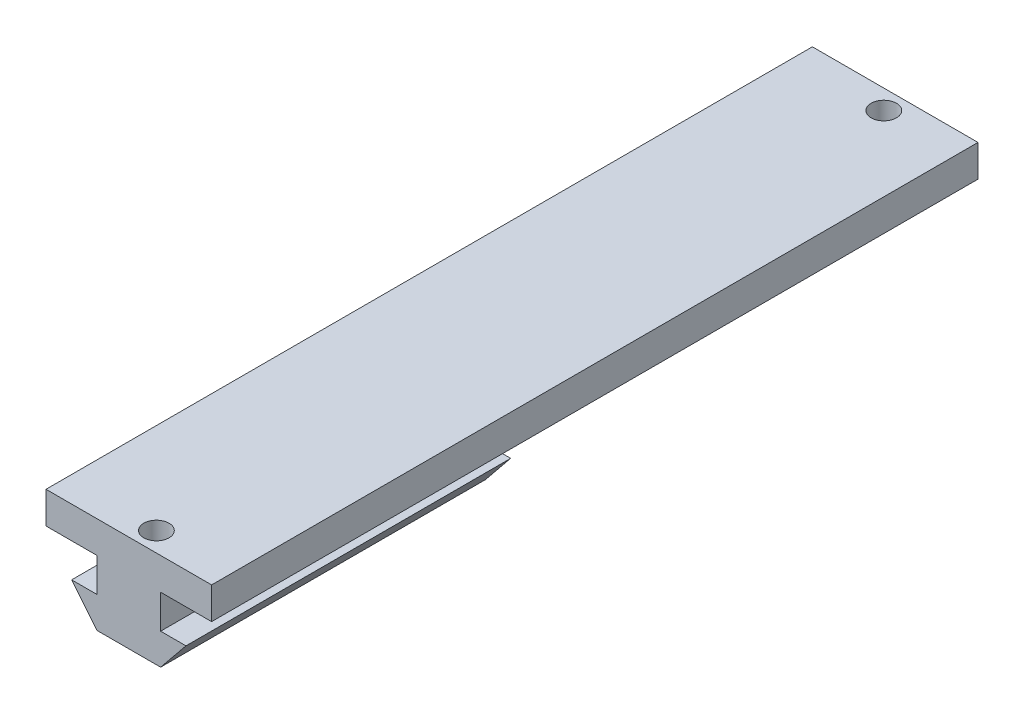
ISO-10303-21;
HEADER;
FILE_DESCRIPTION(('STEP AP214'),'2;1');
FILE_NAME('part.step','',(''),(''),'','','');
FILE_SCHEMA(('AUTOMOTIVE_DESIGN { 1 0 10303 214 1 1 1 1 }'));
ENDSEC;
DATA;
#1=APPLICATION_CONTEXT('core data for automotive mechanical design processes');
#2=APPLICATION_PROTOCOL_DEFINITION('international standard','automotive_design',2000,#1);
#3=PRODUCT_CONTEXT('',#1,'mechanical');
#4=PRODUCT('Part','Part','',(#3));
#5=PRODUCT_RELATED_PRODUCT_CATEGORY('part','',(#4));
#6=PRODUCT_DEFINITION_FORMATION('','',#4);
#7=PRODUCT_DEFINITION_CONTEXT('part definition',#1,'design');
#8=PRODUCT_DEFINITION('design','',#6,#7);
#9=PRODUCT_DEFINITION_SHAPE('','',#8);
#10=(LENGTH_UNIT() NAMED_UNIT(*) SI_UNIT(.MILLI.,.METRE.));
#11=(NAMED_UNIT(*) PLANE_ANGLE_UNIT() SI_UNIT($,.RADIAN.));
#12=(NAMED_UNIT(*) SI_UNIT($,.STERADIAN.) SOLID_ANGLE_UNIT());
#13=UNCERTAINTY_MEASURE_WITH_UNIT(LENGTH_MEASURE(1.E-05),#10,'distance_accuracy_value','');
#14=(GEOMETRIC_REPRESENTATION_CONTEXT(3) GLOBAL_UNCERTAINTY_ASSIGNED_CONTEXT((#13)) GLOBAL_UNIT_ASSIGNED_CONTEXT((#10,
#11,#12)) REPRESENTATION_CONTEXT('',''));
#15=CARTESIAN_POINT('',(0.,0.,0.));
#16=DIRECTION('',(0.,0.,1.));
#17=DIRECTION('',(1.,0.,0.));
#18=AXIS2_PLACEMENT_3D('',#15,#16,#17);
#19=CARTESIAN_POINT('',(12.75,4.9,59.));
#20=DIRECTION('',(-1.,0.,0.));
#21=DIRECTION('',(0.,0.,1.));
#22=AXIS2_PLACEMENT_3D('',#19,#20,#21);
#23=PLANE('',#22);
#24=DIRECTION('',(0.,0.,-1.));
#25=VECTOR('',#24,1.);
#26=CARTESIAN_POINT('',(12.75,0.,59.));
#27=LINE('',#26,#25);
#28=CARTESIAN_POINT('',(12.75,0.,59.));
#29=VERTEX_POINT('',#28);
#30=CARTESIAN_POINT('',(12.75,0.,-59.));
#31=VERTEX_POINT('',#30);
#32=EDGE_CURVE('E220',#29,#31,#27,.T.);
#33=ORIENTED_EDGE('',*,*,#32,.T.);
#34=DIRECTION('',(0.,-1.,0.));
#35=VECTOR('',#34,1.);
#36=CARTESIAN_POINT('',(12.75,4.9,-59.));
#37=LINE('',#36,#35);
#38=CARTESIAN_POINT('',(12.75,4.9,-59.));
#39=VERTEX_POINT('',#38);
#40=EDGE_CURVE('E11',#39,#31,#37,.T.);
#41=ORIENTED_EDGE('',*,*,#40,.F.);
#42=DIRECTION('',(0.,0.,-1.));
#43=VECTOR('',#42,1.);
#44=CARTESIAN_POINT('',(12.75,4.9,59.));
#45=LINE('',#44,#43);
#46=CARTESIAN_POINT('',(12.75,4.9,59.));
#47=VERTEX_POINT('',#46);
#48=EDGE_CURVE('E238',#47,#39,#45,.T.);
#49=ORIENTED_EDGE('',*,*,#48,.F.);
#50=DIRECTION('',(0.,-1.,0.));
#51=VECTOR('',#50,1.);
#52=CARTESIAN_POINT('',(12.75,4.9,59.));
#53=LINE('',#52,#51);
#54=EDGE_CURVE('E249',#47,#29,#53,.T.);
#55=ORIENTED_EDGE('',*,*,#54,.T.);
#56=EDGE_LOOP('',(#33,#41,#49,#55));
#57=FACE_BOUND('',#56,.T.);
#58=ADVANCED_FACE('F44',(#57),#23,.F.);
#59=CARTESIAN_POINT('',(-12.75,4.9,-59.));
#60=DIRECTION('',(0.,0.,1.));
#61=DIRECTION('',(1.,0.,0.));
#62=AXIS2_PLACEMENT_3D('',#59,#60,#61);
#63=PLANE('',#62);
#64=DIRECTION('',(-1.,0.,0.));
#65=VECTOR('',#64,1.);
#66=CARTESIAN_POINT('',(-12.75,0.,-59.));
#67=LINE('',#66,#65);
#68=CARTESIAN_POINT('',(-12.75,0.,-59.));
#69=VERTEX_POINT('',#68);
#70=EDGE_CURVE('E253',#31,#69,#67,.T.);
#71=ORIENTED_EDGE('',*,*,#70,.T.);
#72=DIRECTION('',(0.,-1.,0.));
#73=VECTOR('',#72,1.);
#74=CARTESIAN_POINT('',(-12.75,4.9,-59.));
#75=LINE('',#74,#73);
#76=CARTESIAN_POINT('',(-12.75,4.9,-59.));
#77=VERTEX_POINT('',#76);
#78=EDGE_CURVE('E53',#77,#69,#75,.T.);
#79=ORIENTED_EDGE('',*,*,#78,.F.);
#80=DIRECTION('',(-1.,0.,0.));
#81=VECTOR('',#80,1.);
#82=CARTESIAN_POINT('',(-12.75,4.9,-59.));
#83=LINE('',#82,#81);
#84=EDGE_CURVE('E97',#39,#77,#83,.T.);
#85=ORIENTED_EDGE('',*,*,#84,.F.);
#86=ORIENTED_EDGE('',*,*,#40,.T.);
#87=EDGE_LOOP('',(#71,#79,#85,#86));
#88=FACE_BOUND('',#87,.T.);
#89=ADVANCED_FACE('F295',(#88),#63,.F.);
#90=CARTESIAN_POINT('',(-12.75,4.9,59.));
#91=DIRECTION('',(1.,0.,0.));
#92=DIRECTION('',(0.,0.,-1.));
#93=AXIS2_PLACEMENT_3D('',#90,#91,#92);
#94=PLANE('',#93);
#95=DIRECTION('',(0.,0.,1.));
#96=VECTOR('',#95,1.);
#97=CARTESIAN_POINT('',(-12.75,0.,59.));
#98=LINE('',#97,#96);
#99=CARTESIAN_POINT('',(-12.75,0.,59.));
#100=VERTEX_POINT('',#99);
#101=EDGE_CURVE('E256',#69,#100,#98,.T.);
#102=ORIENTED_EDGE('',*,*,#101,.T.);
#103=DIRECTION('',(0.,-1.,0.));
#104=VECTOR('',#103,1.);
#105=CARTESIAN_POINT('',(-12.75,4.9,59.));
#106=LINE('',#105,#104);
#107=CARTESIAN_POINT('',(-12.75,4.9,59.));
#108=VERTEX_POINT('',#107);
#109=EDGE_CURVE('E263',#108,#100,#106,.T.);
#110=ORIENTED_EDGE('',*,*,#109,.F.);
#111=DIRECTION('',(0.,0.,1.));
#112=VECTOR('',#111,1.);
#113=CARTESIAN_POINT('',(-12.75,4.9,59.));
#114=LINE('',#113,#112);
#115=EDGE_CURVE('E244',#77,#108,#114,.T.);
#116=ORIENTED_EDGE('',*,*,#115,.F.);
#117=ORIENTED_EDGE('',*,*,#78,.T.);
#118=EDGE_LOOP('',(#102,#110,#116,#117));
#119=FACE_BOUND('',#118,.T.);
#120=ADVANCED_FACE('F272',(#119),#94,.F.);
#121=CARTESIAN_POINT('',(-12.75,4.9,59.));
#122=DIRECTION('',(0.,0.,-1.));
#123=DIRECTION('',(-1.,0.,0.));
#124=AXIS2_PLACEMENT_3D('',#121,#122,#123);
#125=PLANE('',#124);
#126=DIRECTION('',(1.,0.,0.));
#127=VECTOR('',#126,1.);
#128=CARTESIAN_POINT('',(-12.75,0.,59.));
#129=LINE('',#128,#127);
#130=CARTESIAN_POINT('',(-4.9,0.,59.));
#131=VERTEX_POINT('',#130);
#132=EDGE_CURVE('E241',#100,#131,#129,.T.);
#133=ORIENTED_EDGE('',*,*,#132,.T.);
#134=DIRECTION('',(0.,-1.,0.));
#135=VECTOR('',#134,1.);
#136=CARTESIAN_POINT('',(-4.9,0.,59.));
#137=LINE('',#136,#135);
#138=CARTESIAN_POINT('',(-4.9,-5.2,59.));
#139=VERTEX_POINT('',#138);
#140=EDGE_CURVE('E60',#131,#139,#137,.T.);
#141=ORIENTED_EDGE('',*,*,#140,.T.);
#142=DIRECTION('',(-1.,0.,0.));
#143=VECTOR('',#142,1.);
#144=CARTESIAN_POINT('',(-4.9,-5.2,59.));
#145=LINE('',#144,#143);
#146=CARTESIAN_POINT('',(-8.8,-5.2,59.));
#147=VERTEX_POINT('',#146);
#148=EDGE_CURVE('E199',#139,#147,#145,.T.);
#149=ORIENTED_EDGE('',*,*,#148,.T.);
#150=DIRECTION('',(0.630592625094466,-0.776114000116266,0.));
#151=VECTOR('',#150,1.);
#152=CARTESIAN_POINT('',(-8.8,-5.2,59.));
#153=LINE('',#152,#151);
#154=CARTESIAN_POINT('',(-4.9,-10.,59.));
#155=VERTEX_POINT('',#154);
#156=EDGE_CURVE('E203',#147,#155,#153,.T.);
#157=ORIENTED_EDGE('',*,*,#156,.T.);
#158=DIRECTION('',(1.,0.,0.));
#159=VECTOR('',#158,1.);
#160=CARTESIAN_POINT('',(-4.9,-10.,59.));
#161=LINE('',#160,#159);
#162=CARTESIAN_POINT('',(4.9,-10.,59.));
#163=VERTEX_POINT('',#162);
#164=EDGE_CURVE('E207',#155,#163,#161,.T.);
#165=ORIENTED_EDGE('',*,*,#164,.T.);
#166=DIRECTION('',(0.630592625094466,0.776114000116266,0.));
#167=VECTOR('',#166,1.);
#168=CARTESIAN_POINT('',(8.8,-5.2,59.));
#169=LINE('',#168,#167);
#170=CARTESIAN_POINT('',(8.8,-5.2,59.));
#171=VERTEX_POINT('',#170);
#172=EDGE_CURVE('E211',#163,#171,#169,.T.);
#173=ORIENTED_EDGE('',*,*,#172,.T.);
#174=DIRECTION('',(-1.,0.,0.));
#175=VECTOR('',#174,1.);
#176=CARTESIAN_POINT('',(4.9,-5.2,59.));
#177=LINE('',#176,#175);
#178=CARTESIAN_POINT('',(4.9,-5.2,59.));
#179=VERTEX_POINT('',#178);
#180=EDGE_CURVE('E171',#171,#179,#177,.T.);
#181=ORIENTED_EDGE('',*,*,#180,.T.);
#182=DIRECTION('',(0.,1.,0.));
#183=VECTOR('',#182,1.);
#184=CARTESIAN_POINT('',(4.9,-5.2,59.));
#185=LINE('',#184,#183);
#186=CARTESIAN_POINT('',(4.9,0.,59.));
#187=VERTEX_POINT('',#186);
#188=EDGE_CURVE('E168',#179,#187,#185,.T.);
#189=ORIENTED_EDGE('',*,*,#188,.T.);
#190=EDGE_CURVE('E90',#187,#29,#129,.T.);
#191=ORIENTED_EDGE('',*,*,#190,.T.);
#192=ORIENTED_EDGE('',*,*,#54,.F.);
#193=DIRECTION('',(1.,0.,0.));
#194=VECTOR('',#193,1.);
#195=CARTESIAN_POINT('',(-12.75,4.9,59.));
#196=LINE('',#195,#194);
#197=EDGE_CURVE('E69',#108,#47,#196,.T.);
#198=ORIENTED_EDGE('',*,*,#197,.F.);
#199=ORIENTED_EDGE('',*,*,#109,.T.);
#200=EDGE_LOOP('',(#133,#141,#149,#157,#165,#173,#181,#189,#191,#192,#198,#199));
#201=FACE_BOUND('',#200,.T.);
#202=ADVANCED_FACE('F275',(#201),#125,.F.);
#203=CARTESIAN_POINT('',(0.,4.9,0.));
#204=DIRECTION('',(0.,-1.,0.));
#205=DIRECTION('',(0.,0.,-1.));
#206=AXIS2_PLACEMENT_3D('',#203,#204,#205);
#207=PLANE('',#206);
#208=CARTESIAN_POINT('',(1.24999999999997,4.9,-56.));
#209=DIRECTION('',(0.,1.,0.));
#210=DIRECTION('',(0.,0.,1.));
#211=AXIS2_PLACEMENT_3D('',#208,#209,#210);
#212=CIRCLE('',#211,1.95);
#213=CARTESIAN_POINT('',(1.24999999999997,4.9,-54.05));
#214=VERTEX_POINT('',#213);
#215=EDGE_CURVE('E481',#214,#214,#212,.T.);
#216=ORIENTED_EDGE('',*,*,#215,.F.);
#217=EDGE_LOOP('',(#216));
#218=FACE_BOUND('',#217,.T.);
#219=CARTESIAN_POINT('',(1.24999999999998,4.9,56.));
#220=DIRECTION('',(0.,1.,0.));
#221=DIRECTION('',(0.,0.,1.));
#222=AXIS2_PLACEMENT_3D('',#219,#220,#221);
#223=CIRCLE('',#222,1.95);
#224=CARTESIAN_POINT('',(1.24999999999998,4.9,57.95));
#225=VERTEX_POINT('',#224);
#226=EDGE_CURVE('E478',#225,#225,#223,.T.);
#227=ORIENTED_EDGE('',*,*,#226,.F.);
#228=EDGE_LOOP('',(#227));
#229=FACE_BOUND('',#228,.T.);
#230=ORIENTED_EDGE('',*,*,#48,.T.);
#231=ORIENTED_EDGE('',*,*,#84,.T.);
#232=ORIENTED_EDGE('',*,*,#115,.T.);
#233=ORIENTED_EDGE('',*,*,#197,.T.);
#234=EDGE_LOOP('',(#230,#231,#232,#233));
#235=FACE_BOUND('',#234,.T.);
#236=ADVANCED_FACE('F279',(#218,#229,#235),#207,.F.);
#237=CARTESIAN_POINT('',(0.,0.,0.));
#238=DIRECTION('',(0.,-1.,0.));
#239=DIRECTION('',(0.,0.,-1.));
#240=AXIS2_PLACEMENT_3D('',#237,#238,#239);
#241=PLANE('',#240);
#242=CARTESIAN_POINT('',(1.24999999999997,0.,-56.));
#243=DIRECTION('',(0.,-1.,0.));
#244=DIRECTION('',(0.,0.,-1.));
#245=AXIS2_PLACEMENT_3D('',#242,#243,#244);
#246=CIRCLE('',#245,1.95);
#247=CARTESIAN_POINT('',(1.24999999999997,0.,-57.95));
#248=VERTEX_POINT('',#247);
#249=EDGE_CURVE('E47',#248,#248,#246,.T.);
#250=ORIENTED_EDGE('',*,*,#249,.F.);
#251=EDGE_LOOP('',(#250));
#252=FACE_BOUND('',#251,.T.);
#253=DIRECTION('',(0.,0.,1.));
#254=VECTOR('',#253,1.);
#255=CARTESIAN_POINT('',(4.9,0.,8.99999999999999));
#256=LINE('',#255,#254);
#257=CARTESIAN_POINT('',(4.9,0.,8.99999999999999));
#258=VERTEX_POINT('',#257);
#259=EDGE_CURVE('E166',#258,#187,#256,.T.);
#260=ORIENTED_EDGE('',*,*,#259,.F.);
#261=DIRECTION('',(-1.,0.,0.));
#262=VECTOR('',#261,1.);
#263=CARTESIAN_POINT('',(4.9,0.,8.99999999999999));
#264=LINE('',#263,#262);
#265=CARTESIAN_POINT('',(-4.9,0.,8.99999999999999));
#266=VERTEX_POINT('',#265);
#267=EDGE_CURVE('E157',#258,#266,#264,.T.);
#268=ORIENTED_EDGE('',*,*,#267,.T.);
#269=DIRECTION('',(0.,0.,1.));
#270=VECTOR('',#269,1.);
#271=CARTESIAN_POINT('',(-4.9,0.,8.99999999999999));
#272=LINE('',#271,#270);
#273=EDGE_CURVE('E141',#266,#131,#272,.T.);
#274=ORIENTED_EDGE('',*,*,#273,.T.);
#275=ORIENTED_EDGE('',*,*,#132,.F.);
#276=ORIENTED_EDGE('',*,*,#101,.F.);
#277=ORIENTED_EDGE('',*,*,#70,.F.);
#278=ORIENTED_EDGE('',*,*,#32,.F.);
#279=ORIENTED_EDGE('',*,*,#190,.F.);
#280=EDGE_LOOP('',(#260,#268,#274,#275,#276,#277,#278,#279));
#281=FACE_BOUND('',#280,.T.);
#282=ADVANCED_FACE('F165',(#252,#281),#241,.T.);
#283=CARTESIAN_POINT('',(4.9,-5.2,8.99999999999999));
#284=DIRECTION('',(1.,0.,0.));
#285=DIRECTION('',(0.,1.,0.));
#286=AXIS2_PLACEMENT_3D('',#283,#284,#285);
#287=PLANE('',#286);
#288=ORIENTED_EDGE('',*,*,#188,.F.);
#289=DIRECTION('',(0.,0.,1.));
#290=VECTOR('',#289,1.);
#291=CARTESIAN_POINT('',(4.9,-5.2,8.99999999999999));
#292=LINE('',#291,#290);
#293=CARTESIAN_POINT('',(4.9,-5.2,8.99999999999999));
#294=VERTEX_POINT('',#293);
#295=EDGE_CURVE('E221',#294,#179,#292,.T.);
#296=ORIENTED_EDGE('',*,*,#295,.F.);
#297=DIRECTION('',(0.,1.,0.));
#298=VECTOR('',#297,1.);
#299=CARTESIAN_POINT('',(4.9,-5.2,8.99999999999999));
#300=LINE('',#299,#298);
#301=EDGE_CURVE('E151',#294,#258,#300,.T.);
#302=ORIENTED_EDGE('',*,*,#301,.T.);
#303=ORIENTED_EDGE('',*,*,#259,.T.);
#304=EDGE_LOOP('',(#288,#296,#302,#303));
#305=FACE_BOUND('',#304,.T.);
#306=ADVANCED_FACE('F287',(#305),#287,.T.);
#307=CARTESIAN_POINT('',(4.9,-5.2,8.99999999999999));
#308=DIRECTION('',(0.,1.,0.));
#309=DIRECTION('',(0.,0.,1.));
#310=AXIS2_PLACEMENT_3D('',#307,#308,#309);
#311=PLANE('',#310);
#312=ORIENTED_EDGE('',*,*,#180,.F.);
#313=DIRECTION('',(0.,0.,1.));
#314=VECTOR('',#313,1.);
#315=CARTESIAN_POINT('',(8.8,-5.2,8.99999999999999));
#316=LINE('',#315,#314);
#317=CARTESIAN_POINT('',(8.8,-5.2,8.99999999999999));
#318=VERTEX_POINT('',#317);
#319=EDGE_CURVE('E224',#318,#171,#316,.T.);
#320=ORIENTED_EDGE('',*,*,#319,.F.);
#321=DIRECTION('',(-1.,0.,0.));
#322=VECTOR('',#321,1.);
#323=CARTESIAN_POINT('',(4.9,-5.2,8.99999999999999));
#324=LINE('',#323,#322);
#325=EDGE_CURVE('E191',#318,#294,#324,.T.);
#326=ORIENTED_EDGE('',*,*,#325,.T.);
#327=ORIENTED_EDGE('',*,*,#295,.T.);
#328=EDGE_LOOP('',(#312,#320,#326,#327));
#329=FACE_BOUND('',#328,.T.);
#330=ADVANCED_FACE('F321',(#329),#311,.T.);
#331=CARTESIAN_POINT('',(8.8,-5.2,8.99999999999999));
#332=DIRECTION('',(0.776114000116266,-0.630592625094465,0.));
#333=DIRECTION('',(0.630592625094465,0.776114000116266,0.));
#334=AXIS2_PLACEMENT_3D('',#331,#332,#333);
#335=PLANE('',#334);
#336=ORIENTED_EDGE('',*,*,#172,.F.);
#337=DIRECTION('',(0.,0.,1.));
#338=VECTOR('',#337,1.);
#339=CARTESIAN_POINT('',(4.9,-10.,8.99999999999999));
#340=LINE('',#339,#338);
#341=CARTESIAN_POINT('',(4.9,-10.,8.99999999999999));
#342=VERTEX_POINT('',#341);
#343=EDGE_CURVE('E227',#342,#163,#340,.T.);
#344=ORIENTED_EDGE('',*,*,#343,.F.);
#345=DIRECTION('',(0.630592625094466,0.776114000116266,0.));
#346=VECTOR('',#345,1.);
#347=CARTESIAN_POINT('',(8.8,-5.2,8.99999999999999));
#348=LINE('',#347,#346);
#349=EDGE_CURVE('E187',#342,#318,#348,.T.);
#350=ORIENTED_EDGE('',*,*,#349,.T.);
#351=ORIENTED_EDGE('',*,*,#319,.T.);
#352=EDGE_LOOP('',(#336,#344,#350,#351));
#353=FACE_BOUND('',#352,.T.);
#354=ADVANCED_FACE('F332',(#353),#335,.T.);
#355=CARTESIAN_POINT('',(-4.9,-10.,8.99999999999999));
#356=DIRECTION('',(0.,-1.,0.));
#357=DIRECTION('',(1.,0.,0.));
#358=AXIS2_PLACEMENT_3D('',#355,#356,#357);
#359=PLANE('',#358);
#360=ORIENTED_EDGE('',*,*,#164,.F.);
#361=DIRECTION('',(0.,0.,1.));
#362=VECTOR('',#361,1.);
#363=CARTESIAN_POINT('',(-4.9,-10.,8.99999999999999));
#364=LINE('',#363,#362);
#365=CARTESIAN_POINT('',(-4.9,-10.,8.99999999999999));
#366=VERTEX_POINT('',#365);
#367=EDGE_CURVE('E230',#366,#155,#364,.T.);
#368=ORIENTED_EDGE('',*,*,#367,.F.);
#369=DIRECTION('',(1.,0.,0.));
#370=VECTOR('',#369,1.);
#371=CARTESIAN_POINT('',(-4.9,-10.,8.99999999999999));
#372=LINE('',#371,#370);
#373=EDGE_CURVE('E183',#366,#342,#372,.T.);
#374=ORIENTED_EDGE('',*,*,#373,.T.);
#375=ORIENTED_EDGE('',*,*,#343,.T.);
#376=EDGE_LOOP('',(#360,#368,#374,#375));
#377=FACE_BOUND('',#376,.T.);
#378=ADVANCED_FACE('F343',(#377),#359,.T.);
#379=CARTESIAN_POINT('',(-8.8,-5.2,8.99999999999999));
#380=DIRECTION('',(-0.776114000116266,-0.630592625094466,0.));
#381=DIRECTION('',(0.630592625094466,-0.776114000116266,0.));
#382=AXIS2_PLACEMENT_3D('',#379,#380,#381);
#383=PLANE('',#382);
#384=ORIENTED_EDGE('',*,*,#156,.F.);
#385=DIRECTION('',(0.,0.,1.));
#386=VECTOR('',#385,1.);
#387=CARTESIAN_POINT('',(-8.8,-5.2,8.99999999999999));
#388=LINE('',#387,#386);
#389=CARTESIAN_POINT('',(-8.8,-5.2,8.99999999999999));
#390=VERTEX_POINT('',#389);
#391=EDGE_CURVE('E233',#390,#147,#388,.T.);
#392=ORIENTED_EDGE('',*,*,#391,.F.);
#393=DIRECTION('',(0.630592625094466,-0.776114000116266,0.));
#394=VECTOR('',#393,1.);
#395=CARTESIAN_POINT('',(-8.8,-5.2,8.99999999999999));
#396=LINE('',#395,#394);
#397=EDGE_CURVE('E179',#390,#366,#396,.T.);
#398=ORIENTED_EDGE('',*,*,#397,.T.);
#399=ORIENTED_EDGE('',*,*,#367,.T.);
#400=EDGE_LOOP('',(#384,#392,#398,#399));
#401=FACE_BOUND('',#400,.T.);
#402=ADVANCED_FACE('F354',(#401),#383,.T.);
#403=CARTESIAN_POINT('',(-4.9,-5.2,8.99999999999999));
#404=DIRECTION('',(0.,1.,0.));
#405=DIRECTION('',(-1.,0.,0.));
#406=AXIS2_PLACEMENT_3D('',#403,#404,#405);
#407=PLANE('',#406);
#408=ORIENTED_EDGE('',*,*,#148,.F.);
#409=DIRECTION('',(0.,0.,1.));
#410=VECTOR('',#409,1.);
#411=CARTESIAN_POINT('',(-4.9,-5.2,8.99999999999999));
#412=LINE('',#411,#410);
#413=CARTESIAN_POINT('',(-4.9,-5.2,8.99999999999999));
#414=VERTEX_POINT('',#413);
#415=EDGE_CURVE('E150',#414,#139,#412,.T.);
#416=ORIENTED_EDGE('',*,*,#415,.F.);
#417=DIRECTION('',(-1.,0.,0.));
#418=VECTOR('',#417,1.);
#419=CARTESIAN_POINT('',(-4.9,-5.2,8.99999999999999));
#420=LINE('',#419,#418);
#421=EDGE_CURVE('E161',#414,#390,#420,.T.);
#422=ORIENTED_EDGE('',*,*,#421,.T.);
#423=ORIENTED_EDGE('',*,*,#391,.T.);
#424=EDGE_LOOP('',(#408,#416,#422,#423));
#425=FACE_BOUND('',#424,.T.);
#426=ADVANCED_FACE('F365',(#425),#407,.T.);
#427=CARTESIAN_POINT('',(-4.9,0.,8.99999999999999));
#428=DIRECTION('',(-1.,0.,0.));
#429=DIRECTION('',(0.,-1.,0.));
#430=AXIS2_PLACEMENT_3D('',#427,#428,#429);
#431=PLANE('',#430);
#432=ORIENTED_EDGE('',*,*,#140,.F.);
#433=ORIENTED_EDGE('',*,*,#273,.F.);
#434=DIRECTION('',(0.,-1.,0.));
#435=VECTOR('',#434,1.);
#436=CARTESIAN_POINT('',(-4.9,0.,8.99999999999999));
#437=LINE('',#436,#435);
#438=EDGE_CURVE('E144',#266,#414,#437,.T.);
#439=ORIENTED_EDGE('',*,*,#438,.T.);
#440=ORIENTED_EDGE('',*,*,#415,.T.);
#441=EDGE_LOOP('',(#432,#433,#439,#440));
#442=FACE_BOUND('',#441,.T.);
#443=ADVANCED_FACE('F143',(#442),#431,.T.);
#444=CARTESIAN_POINT('',(0.,0.,8.99999999999999));
#445=DIRECTION('',(0.,0.,1.));
#446=DIRECTION('',(1.,0.,0.));
#447=AXIS2_PLACEMENT_3D('',#444,#445,#446);
#448=PLANE('',#447);
#449=ORIENTED_EDGE('',*,*,#267,.F.);
#450=ORIENTED_EDGE('',*,*,#301,.F.);
#451=ORIENTED_EDGE('',*,*,#325,.F.);
#452=ORIENTED_EDGE('',*,*,#349,.F.);
#453=ORIENTED_EDGE('',*,*,#373,.F.);
#454=ORIENTED_EDGE('',*,*,#397,.F.);
#455=ORIENTED_EDGE('',*,*,#421,.F.);
#456=ORIENTED_EDGE('',*,*,#438,.F.);
#457=EDGE_LOOP('',(#449,#450,#451,#452,#453,#454,#455,#456));
#458=FACE_BOUND('',#457,.T.);
#459=ADVANCED_FACE('F155',(#458),#448,.F.);
#460=CARTESIAN_POINT('',(1.24999999999997,-5.1,-56.));
#461=DIRECTION('',(0.,1.,0.));
#462=DIRECTION('',(0.,0.,1.));
#463=AXIS2_PLACEMENT_3D('',#460,#461,#462);
#464=CYLINDRICAL_SURFACE('',#463,1.95);
#465=ORIENTED_EDGE('',*,*,#249,.T.);
#466=EDGE_LOOP('',(#465));
#467=FACE_BOUND('',#466,.T.);
#468=ORIENTED_EDGE('',*,*,#215,.T.);
#469=EDGE_LOOP('',(#468));
#470=FACE_BOUND('',#469,.T.);
#471=ADVANCED_FACE('F393',(#467,#470),#464,.F.);
#472=CARTESIAN_POINT('',(1.24999999999998,-5.1,56.));
#473=DIRECTION('',(0.,1.,0.));
#474=DIRECTION('',(0.,0.,1.));
#475=AXIS2_PLACEMENT_3D('',#472,#473,#474);
#476=CYLINDRICAL_SURFACE('',#475,1.95);
#477=CARTESIAN_POINT('',(1.24999999999998,-5.1,56.));
#478=DIRECTION('',(0.,1.,0.));
#479=DIRECTION('',(0.,0.,1.));
#480=AXIS2_PLACEMENT_3D('',#477,#478,#479);
#481=CIRCLE('',#480,1.95);
#482=CARTESIAN_POINT('',(1.24999999999998,-5.1,57.95));
#483=VERTEX_POINT('',#482);
#484=EDGE_CURVE('E174',#483,#483,#481,.T.);
#485=ORIENTED_EDGE('',*,*,#484,.F.);
#486=EDGE_LOOP('',(#485));
#487=FACE_BOUND('',#486,.T.);
#488=ORIENTED_EDGE('',*,*,#226,.T.);
#489=EDGE_LOOP('',(#488));
#490=FACE_BOUND('',#489,.T.);
#491=ADVANCED_FACE('F415',(#487,#490),#476,.F.);
#492=CARTESIAN_POINT('',(1.24999999999998,-5.1,56.));
#493=DIRECTION('',(0.,1.,0.));
#494=DIRECTION('',(0.,0.,1.));
#495=AXIS2_PLACEMENT_3D('',#492,#493,#494);
#496=PLANE('',#495);
#497=ORIENTED_EDGE('',*,*,#484,.T.);
#498=EDGE_LOOP('',(#497));
#499=FACE_BOUND('',#498,.T.);
#500=ADVANCED_FACE('F426',(#499),#496,.T.);
#501=CLOSED_SHELL('',(#58,#89,#120,#202,#236,#282,#306,#330,#354,#378,#402,#426,#443,#459,#471,
#491,#500));
#502=MANIFOLD_SOLID_BREP('B2',#501);
#503=ADVANCED_BREP_SHAPE_REPRESENTATION('',(#18,#502),#14);
#504=SHAPE_DEFINITION_REPRESENTATION(#9,#503);
ENDSEC;
END-ISO-10303-21;
